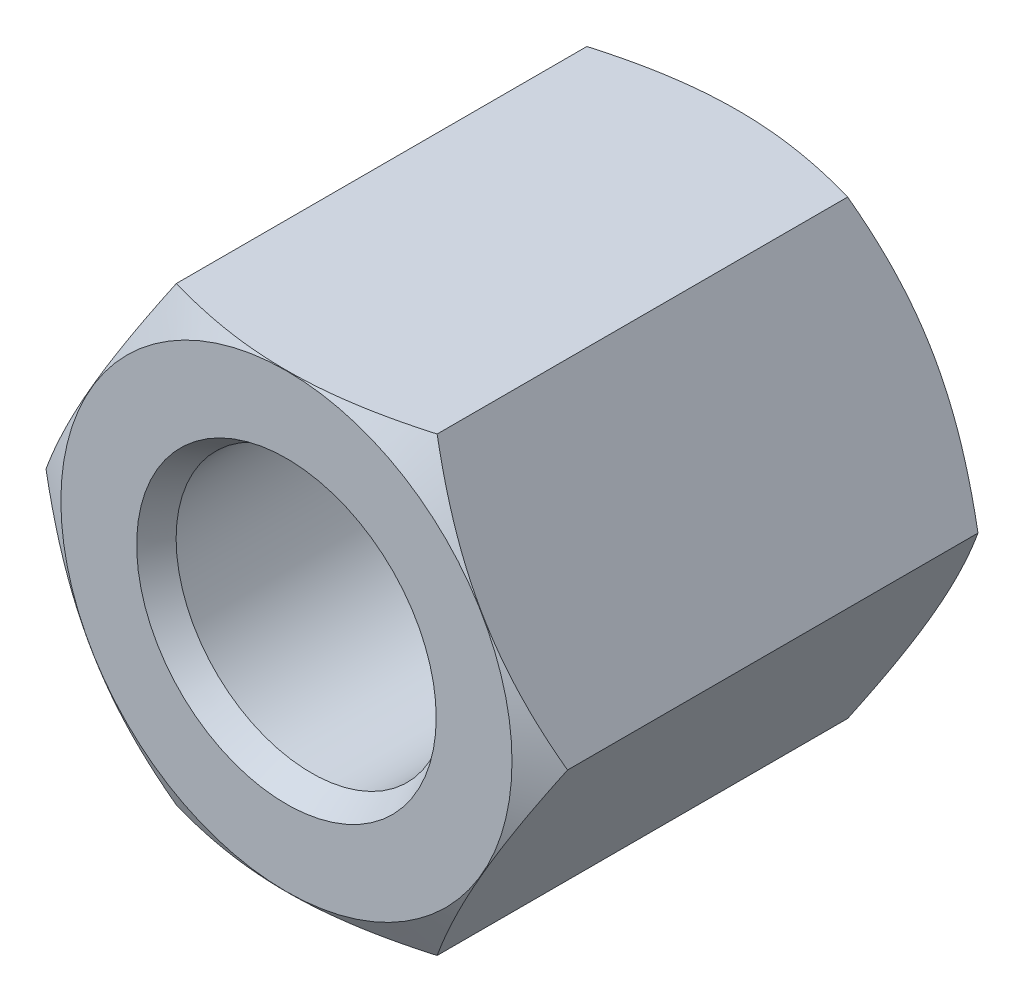
ISO-10303-21;
HEADER;
FILE_DESCRIPTION(('STEP AP214'),'2;1');
FILE_NAME('part.step','',(''),(''),'','','');
FILE_SCHEMA(('AUTOMOTIVE_DESIGN { 1 0 10303 214 1 1 1 1 }'));
ENDSEC;
DATA;
#1=APPLICATION_CONTEXT('core data for automotive mechanical design processes');
#2=APPLICATION_PROTOCOL_DEFINITION('international standard','automotive_design',2000,#1);
#3=PRODUCT_CONTEXT('',#1,'mechanical');
#4=PRODUCT('Part','Part','',(#3));
#5=PRODUCT_RELATED_PRODUCT_CATEGORY('part','',(#4));
#6=PRODUCT_DEFINITION_FORMATION('','',#4);
#7=PRODUCT_DEFINITION_CONTEXT('part definition',#1,'design');
#8=PRODUCT_DEFINITION('design','',#6,#7);
#9=PRODUCT_DEFINITION_SHAPE('','',#8);
#10=(LENGTH_UNIT() NAMED_UNIT(*) SI_UNIT(.MILLI.,.METRE.));
#11=(NAMED_UNIT(*) PLANE_ANGLE_UNIT() SI_UNIT($,.RADIAN.));
#12=(NAMED_UNIT(*) SI_UNIT($,.STERADIAN.) SOLID_ANGLE_UNIT());
#13=UNCERTAINTY_MEASURE_WITH_UNIT(LENGTH_MEASURE(1.E-05),#10,'distance_accuracy_value','');
#14=(GEOMETRIC_REPRESENTATION_CONTEXT(3) GLOBAL_UNCERTAINTY_ASSIGNED_CONTEXT((#13)) GLOBAL_UNIT_ASSIGNED_CONTEXT((#10,
#11,#12)) REPRESENTATION_CONTEXT('',''));
#15=CARTESIAN_POINT('',(0.,0.,0.));
#16=DIRECTION('',(0.,0.,1.));
#17=DIRECTION('',(1.,0.,0.));
#18=AXIS2_PLACEMENT_3D('',#15,#16,#17);
#19=CARTESIAN_POINT('',(0.,0.,4.72287187079));
#20=DIRECTION('',(0.,0.,-1.));
#21=DIRECTION('',(1.,0.,0.));
#22=AXIS2_PLACEMENT_3D('',#19,#20,#21);
#23=CYLINDRICAL_SURFACE('',#22,1.5);
#24=CARTESIAN_POINT('',(0.,0.,4.72287187079));
#25=DIRECTION('',(0.,0.,1.));
#26=DIRECTION('',(1.,0.,0.));
#27=AXIS2_PLACEMENT_3D('',#24,#25,#26);
#28=CIRCLE('',#27,1.5);
#29=CARTESIAN_POINT('',(1.5,0.,4.72287187079));
#30=VERTEX_POINT('',#29);
#31=EDGE_CURVE('E133',#30,#30,#28,.T.);
#32=ORIENTED_EDGE('',*,*,#31,.T.);
#33=DIRECTION('',(0.,0.,-1.));
#34=VECTOR('',#33,1.);
#35=CARTESIAN_POINT('',(1.5,0.,4.72287187079));
#36=LINE('',#35,#34);
#37=CARTESIAN_POINT('',(1.5,0.,2.5));
#38=VERTEX_POINT('',#37);
#39=EDGE_CURVE('E11',#30,#38,#36,.T.);
#40=ORIENTED_EDGE('',*,*,#39,.T.);
#41=CARTESIAN_POINT('',(0.,0.,2.5));
#42=DIRECTION('',(0.,0.,1.));
#43=DIRECTION('',(1.,0.,0.));
#44=AXIS2_PLACEMENT_3D('',#41,#42,#43);
#45=CIRCLE('',#44,1.5);
#46=EDGE_CURVE('E135',#38,#38,#45,.T.);
#47=ORIENTED_EDGE('',*,*,#46,.F.);
#48=ORIENTED_EDGE('',*,*,#39,.F.);
#49=EDGE_LOOP('',(#32,#40,#47,#48));
#50=FACE_BOUND('',#49,.T.);
#51=ADVANCED_FACE('F16',(#50),#23,.F.);
#52=CARTESIAN_POINT('',(0.,0.,2.5));
#53=DIRECTION('',(0.,0.,-1.));
#54=DIRECTION('',(1.,0.,0.));
#55=AXIS2_PLACEMENT_3D('',#52,#53,#54);
#56=CYLINDRICAL_SURFACE('',#55,1.5);
#57=ORIENTED_EDGE('',*,*,#46,.T.);
#58=DIRECTION('',(0.,0.,-1.));
#59=VECTOR('',#58,1.);
#60=CARTESIAN_POINT('',(1.5,0.,2.5));
#61=LINE('',#60,#59);
#62=CARTESIAN_POINT('',(1.5,0.,0.27712812921));
#63=VERTEX_POINT('',#62);
#64=EDGE_CURVE('E20',#38,#63,#61,.T.);
#65=ORIENTED_EDGE('',*,*,#64,.T.);
#66=CARTESIAN_POINT('',(0.,0.,0.27712812921));
#67=DIRECTION('',(0.,0.,1.));
#68=DIRECTION('',(1.,0.,0.));
#69=AXIS2_PLACEMENT_3D('',#66,#67,#68);
#70=CIRCLE('',#69,1.5);
#71=EDGE_CURVE('E191',#63,#63,#70,.T.);
#72=ORIENTED_EDGE('',*,*,#71,.F.);
#73=ORIENTED_EDGE('',*,*,#64,.F.);
#74=EDGE_LOOP('',(#57,#65,#72,#73));
#75=FACE_BOUND('',#74,.T.);
#76=ADVANCED_FACE('F311',(#75),#56,.F.);
#77=CARTESIAN_POINT('',(0.,0.,5.));
#78=DIRECTION('',(0.,0.,1.));
#79=DIRECTION('',(1.,0.,0.));
#80=AXIS2_PLACEMENT_3D('',#77,#78,#79);
#81=CONICAL_SURFACE('',#80,1.66,0.5235987756);
#82=CARTESIAN_POINT('',(0.,0.,5.));
#83=DIRECTION('',(0.,0.,1.));
#84=DIRECTION('',(1.,0.,0.));
#85=AXIS2_PLACEMENT_3D('',#82,#83,#84);
#86=CIRCLE('',#85,1.66);
#87=CARTESIAN_POINT('',(1.66,0.,5.));
#88=VERTEX_POINT('',#87);
#89=EDGE_CURVE('E169',#88,#88,#86,.T.);
#90=ORIENTED_EDGE('',*,*,#89,.T.);
#91=DIRECTION('',(-0.50000000000094,0.,-0.866025403783896));
#92=VECTOR('',#91,1.);
#93=CARTESIAN_POINT('',(1.66,0.,5.));
#94=LINE('',#93,#92);
#95=EDGE_CURVE('E136',#88,#30,#94,.T.);
#96=ORIENTED_EDGE('',*,*,#95,.T.);
#97=ORIENTED_EDGE('',*,*,#31,.F.);
#98=ORIENTED_EDGE('',*,*,#95,.F.);
#99=EDGE_LOOP('',(#90,#96,#97,#98));
#100=FACE_BOUND('',#99,.T.);
#101=ADVANCED_FACE('F316',(#100),#81,.F.);
#102=CARTESIAN_POINT('',(0.,0.,0.27712812921));
#103=DIRECTION('',(0.,0.,-1.));
#104=DIRECTION('',(1.,0.,0.));
#105=AXIS2_PLACEMENT_3D('',#102,#103,#104);
#106=CONICAL_SURFACE('',#105,1.5,0.5235987756);
#107=ORIENTED_EDGE('',*,*,#71,.T.);
#108=DIRECTION('',(0.50000000000094,0.,-0.866025403783896));
#109=VECTOR('',#108,1.);
#110=CARTESIAN_POINT('',(1.5,0.,0.27712812921));
#111=LINE('',#110,#109);
#112=CARTESIAN_POINT('',(1.66,0.,0.));
#113=VERTEX_POINT('',#112);
#114=EDGE_CURVE('E247',#63,#113,#111,.T.);
#115=ORIENTED_EDGE('',*,*,#114,.T.);
#116=CARTESIAN_POINT('',(0.,0.,0.));
#117=DIRECTION('',(0.,0.,1.));
#118=DIRECTION('',(1.,0.,0.));
#119=AXIS2_PLACEMENT_3D('',#116,#117,#118);
#120=CIRCLE('',#119,1.66);
#121=EDGE_CURVE('E165',#113,#113,#120,.T.);
#122=ORIENTED_EDGE('',*,*,#121,.F.);
#123=ORIENTED_EDGE('',*,*,#114,.F.);
#124=EDGE_LOOP('',(#107,#115,#122,#123));
#125=FACE_BOUND('',#124,.T.);
#126=ADVANCED_FACE('F290',(#125),#106,.F.);
#127=CARTESIAN_POINT('',(0.,0.,5.));
#128=DIRECTION('',(0.,0.,1.));
#129=DIRECTION('',(1.,0.,0.));
#130=AXIS2_PLACEMENT_3D('',#127,#128,#129);
#131=PLANE('',#130);
#132=ORIENTED_EDGE('',*,*,#89,.F.);
#133=EDGE_LOOP('',(#132));
#134=FACE_BOUND('',#133,.T.);
#135=CARTESIAN_POINT('',(0.,0.,5.));
#136=DIRECTION('',(0.,0.,1.));
#137=DIRECTION('',(1.,0.,0.));
#138=AXIS2_PLACEMENT_3D('',#135,#136,#137);
#139=CIRCLE('',#138,2.5);
#140=CARTESIAN_POINT('',(2.5,0.,5.));
#141=VERTEX_POINT('',#140);
#142=EDGE_CURVE('E112',#141,#141,#139,.T.);
#143=ORIENTED_EDGE('',*,*,#142,.T.);
#144=EDGE_LOOP('',(#143));
#145=FACE_BOUND('',#144,.T.);
#146=ADVANCED_FACE('F113',(#134,#145),#131,.T.);
#147=CARTESIAN_POINT('',(0.,0.,0.));
#148=DIRECTION('',(0.,0.,1.));
#149=DIRECTION('',(1.,0.,0.));
#150=AXIS2_PLACEMENT_3D('',#147,#148,#149);
#151=PLANE('',#150);
#152=CARTESIAN_POINT('',(0.,0.,0.));
#153=DIRECTION('',(0.,0.,1.));
#154=DIRECTION('',(1.,0.,0.));
#155=AXIS2_PLACEMENT_3D('',#152,#153,#154);
#156=CIRCLE('',#155,2.5);
#157=CARTESIAN_POINT('',(2.5,0.,0.));
#158=VERTEX_POINT('',#157);
#159=EDGE_CURVE('E143',#158,#158,#156,.T.);
#160=ORIENTED_EDGE('',*,*,#159,.F.);
#161=EDGE_LOOP('',(#160));
#162=FACE_BOUND('',#161,.T.);
#163=ORIENTED_EDGE('',*,*,#121,.T.);
#164=EDGE_LOOP('',(#163));
#165=FACE_BOUND('',#164,.T.);
#166=ADVANCED_FACE('F292',(#162,#165),#151,.F.);
#167=CARTESIAN_POINT('',(-1.445,-2.502813416937,0.));
#168=DIRECTION('',(0.,1.,0.));
#169=DIRECTION('',(1.,0.,0.));
#170=AXIS2_PLACEMENT_3D('',#167,#168,#169);
#171=PLANE('',#170);
#172=DIRECTION('',(0.,0.,1.));
#173=VECTOR('',#172,1.);
#174=CARTESIAN_POINT('',(1.445,-2.502813416937,0.));
#175=LINE('',#174,#173);
#176=CARTESIAN_POINT('',(1.445,-2.502813416937,0.225166604984));
#177=VERTEX_POINT('',#176);
#178=CARTESIAN_POINT('',(1.445,-2.502813416937,4.774833395016));
#179=VERTEX_POINT('',#178);
#180=EDGE_CURVE('E150',#177,#179,#175,.T.);
#181=ORIENTED_EDGE('',*,*,#180,.T.);
#182=CARTESIAN_POINT('',(1.44500000000008,-2.502813416937,4.77483339501595));
#183=CARTESIAN_POINT('',(0.,-2.50281341693702,5.1919689645055));
#184=CARTESIAN_POINT('',(-1.44499999999997,-2.502813416937,4.77483339501598));
#185=(BOUNDED_CURVE() B_SPLINE_CURVE(2,(#182,#183,#184),.UNSPECIFIED.,.F.,
.F.) B_SPLINE_CURVE_WITH_KNOTS((3,3),(0.,1.),
.UNSPECIFIED.) CURVE() GEOMETRIC_REPRESENTATION_ITEM() RATIONAL_B_SPLINE_CURVE((1.,
1.15470053837926,1.)) REPRESENTATION_ITEM(''));
#186=CARTESIAN_POINT('',(-1.445,-2.502813416937,4.774833395016));
#187=VERTEX_POINT('',#186);
#188=EDGE_CURVE('E153',#179,#187,#185,.T.);
#189=ORIENTED_EDGE('',*,*,#188,.T.);
#190=DIRECTION('',(0.,0.,1.));
#191=VECTOR('',#190,1.);
#192=CARTESIAN_POINT('',(-1.445,-2.502813416937,0.));
#193=LINE('',#192,#191);
#194=CARTESIAN_POINT('',(-1.445,-2.502813416937,0.225166604984));
#195=VERTEX_POINT('',#194);
#196=EDGE_CURVE('E149',#195,#187,#193,.T.);
#197=ORIENTED_EDGE('',*,*,#196,.F.);
#198=CARTESIAN_POINT('',(-1.44500000000008,-2.502813416937,0.225166604984046));
#199=CARTESIAN_POINT('',(0.,-2.50281341693701,-0.191968964505495));
#200=CARTESIAN_POINT('',(1.44499999999997,-2.502813416937,0.225166604984016));
#201=(BOUNDED_CURVE() B_SPLINE_CURVE(2,(#198,#199,#200),.UNSPECIFIED.,.F.,
.F.) B_SPLINE_CURVE_WITH_KNOTS((3,3),(0.,1.),
.UNSPECIFIED.) CURVE() GEOMETRIC_REPRESENTATION_ITEM() RATIONAL_B_SPLINE_CURVE((1.,
1.15470053837926,1.)) REPRESENTATION_ITEM(''));
#202=EDGE_CURVE('E142',#195,#177,#201,.T.);
#203=ORIENTED_EDGE('',*,*,#202,.T.);
#204=EDGE_LOOP('',(#181,#189,#197,#203));
#205=FACE_BOUND('',#204,.T.);
#206=ADVANCED_FACE('F294',(#205),#171,.F.);
#207=CARTESIAN_POINT('',(-2.89,0.,0.));
#208=DIRECTION('',(0.866025403784329,0.50000000000019,0.));
#209=DIRECTION('',(0.,0.,-1.));
#210=AXIS2_PLACEMENT_3D('',#207,#208,#209);
#211=PLANE('',#210);
#212=ORIENTED_EDGE('',*,*,#196,.T.);
#213=CARTESIAN_POINT('',(-1.44499999999986,-2.50281341693713,4.77483339501589));
#214=CARTESIAN_POINT('',(-2.16750000000006,-1.25140670846891,5.19196896450558));
#215=CARTESIAN_POINT('',(-2.89000000000029,-6.22391027604863E-13,4.77483339501581));
#216=(BOUNDED_CURVE() B_SPLINE_CURVE(2,(#213,#214,#215),.UNSPECIFIED.,.F.,
.F.) B_SPLINE_CURVE_WITH_KNOTS((3,3),(0.,1.),
.UNSPECIFIED.) CURVE() GEOMETRIC_REPRESENTATION_ITEM() RATIONAL_B_SPLINE_CURVE((1.,
1.15470053837934,1.)) REPRESENTATION_ITEM(''));
#217=CARTESIAN_POINT('',(-2.89,0.,4.774833395016));
#218=VERTEX_POINT('',#217);
#219=EDGE_CURVE('E124',#187,#218,#216,.T.);
#220=ORIENTED_EDGE('',*,*,#219,.T.);
#221=DIRECTION('',(0.,0.,1.));
#222=VECTOR('',#221,1.);
#223=CARTESIAN_POINT('',(-2.89,0.,0.));
#224=LINE('',#223,#222);
#225=CARTESIAN_POINT('',(-2.89,0.,0.225166604984));
#226=VERTEX_POINT('',#225);
#227=EDGE_CURVE('E105',#226,#218,#224,.T.);
#228=ORIENTED_EDGE('',*,*,#227,.F.);
#229=CARTESIAN_POINT('',(-2.89000000000094,5.09592368302947E-13,0.225166604984566));
#230=CARTESIAN_POINT('',(-2.16750000000034,-1.2514067084684,-0.191968964505698));
#231=CARTESIAN_POINT('',(-1.44499999999998,-2.50281341693691,0.225166604984036));
#232=(BOUNDED_CURVE() B_SPLINE_CURVE(2,(#229,#230,#231),.UNSPECIFIED.,.F.,
.F.) B_SPLINE_CURVE_WITH_KNOTS((3,3),(0.,1.),
.UNSPECIFIED.) CURVE() GEOMETRIC_REPRESENTATION_ITEM() RATIONAL_B_SPLINE_CURVE((1.,
1.15470053837945,1.)) REPRESENTATION_ITEM(''));
#233=EDGE_CURVE('E159',#226,#195,#232,.T.);
#234=ORIENTED_EDGE('',*,*,#233,.T.);
#235=EDGE_LOOP('',(#212,#220,#228,#234));
#236=FACE_BOUND('',#235,.T.);
#237=ADVANCED_FACE('F302',(#236),#211,.F.);
#238=CARTESIAN_POINT('',(-1.445,2.502813416937,0.));
#239=DIRECTION('',(0.866025403784329,-0.50000000000019,0.));
#240=DIRECTION('',(0.,0.,-1.));
#241=AXIS2_PLACEMENT_3D('',#238,#239,#240);
#242=PLANE('',#241);
#243=ORIENTED_EDGE('',*,*,#227,.T.);
#244=CARTESIAN_POINT('',(-2.89000000000108,-7.4718009557273E-13,4.77483339501536));
#245=CARTESIAN_POINT('',(-2.1675000000004,1.25140670846831,5.19196896450573));
#246=CARTESIAN_POINT('',(-1.44499999999998,2.50281341693692,4.77483339501596));
#247=(BOUNDED_CURVE() B_SPLINE_CURVE(2,(#244,#245,#246),.UNSPECIFIED.,.F.,
.F.) B_SPLINE_CURVE_WITH_KNOTS((3,3),(0.,1.),
.UNSPECIFIED.) CURVE() GEOMETRIC_REPRESENTATION_ITEM() RATIONAL_B_SPLINE_CURVE((1.,
1.15470053837947,1.)) REPRESENTATION_ITEM(''));
#248=CARTESIAN_POINT('',(-1.445,2.502813416937,4.774833395016));
#249=VERTEX_POINT('',#248);
#250=EDGE_CURVE('E117',#218,#249,#247,.T.);
#251=ORIENTED_EDGE('',*,*,#250,.T.);
#252=DIRECTION('',(0.,0.,1.));
#253=VECTOR('',#252,1.);
#254=CARTESIAN_POINT('',(-1.445,2.502813416937,0.));
#255=LINE('',#254,#253);
#256=CARTESIAN_POINT('',(-1.445,2.502813416937,0.225166604984));
#257=VERTEX_POINT('',#256);
#258=EDGE_CURVE('E131',#257,#249,#255,.T.);
#259=ORIENTED_EDGE('',*,*,#258,.F.);
#260=CARTESIAN_POINT('',(-1.44499999999986,2.50281341693713,0.225166604984106));
#261=CARTESIAN_POINT('',(-2.16750000000007,1.25140670846888,-0.191968964505593));
#262=CARTESIAN_POINT('',(-2.89000000000033,5.42899059041702E-13,0.225166604984216));
#263=(BOUNDED_CURVE() B_SPLINE_CURVE(2,(#260,#261,#262),.UNSPECIFIED.,.F.,
.F.) B_SPLINE_CURVE_WITH_KNOTS((3,3),(0.,1.),
.UNSPECIFIED.) CURVE() GEOMETRIC_REPRESENTATION_ITEM() RATIONAL_B_SPLINE_CURVE((1.,
1.15470053837935,1.)) REPRESENTATION_ITEM(''));
#264=EDGE_CURVE('E175',#257,#226,#263,.T.);
#265=ORIENTED_EDGE('',*,*,#264,.T.);
#266=EDGE_LOOP('',(#243,#251,#259,#265));
#267=FACE_BOUND('',#266,.T.);
#268=ADVANCED_FACE('F342',(#267),#242,.F.);
#269=CARTESIAN_POINT('',(1.445,-2.502813416937,0.));
#270=DIRECTION('',(-0.866025403784329,0.50000000000019,0.));
#271=DIRECTION('',(0.,0.,1.));
#272=AXIS2_PLACEMENT_3D('',#269,#270,#271);
#273=PLANE('',#272);
#274=DIRECTION('',(0.,0.,1.));
#275=VECTOR('',#274,1.);
#276=CARTESIAN_POINT('',(2.89,0.,0.225166604984));
#277=LINE('',#276,#275);
#278=CARTESIAN_POINT('',(2.89,0.,0.225166604984));
#279=VERTEX_POINT('',#278);
#280=CARTESIAN_POINT('',(2.89,0.,4.774833395016));
#281=VERTEX_POINT('',#280);
#282=EDGE_CURVE('E222',#279,#281,#277,.T.);
#283=ORIENTED_EDGE('',*,*,#282,.T.);
#284=CARTESIAN_POINT('',(2.89000000000101,6.29496454962464E-13,4.77483339501539));
#285=CARTESIAN_POINT('',(2.16750000000037,-1.25140670846836,5.19196896450572));
#286=CARTESIAN_POINT('',(1.44499999999998,-2.50281341693692,4.77483339501596));
#287=(BOUNDED_CURVE() B_SPLINE_CURVE(2,(#284,#285,#286),.UNSPECIFIED.,.F.,
.F.) B_SPLINE_CURVE_WITH_KNOTS((3,3),(0.,1.),
.UNSPECIFIED.) CURVE() GEOMETRIC_REPRESENTATION_ITEM() RATIONAL_B_SPLINE_CURVE((1.,
1.15470053837946,1.)) REPRESENTATION_ITEM(''));
#288=EDGE_CURVE('E127',#281,#179,#287,.T.);
#289=ORIENTED_EDGE('',*,*,#288,.T.);
#290=ORIENTED_EDGE('',*,*,#180,.F.);
#291=CARTESIAN_POINT('',(1.44499999999986,-2.50281341693713,0.225166604984106));
#292=CARTESIAN_POINT('',(2.16750000000006,-1.25140670846889,-0.191968964505588));
#293=CARTESIAN_POINT('',(2.89000000000031,-5.83089132533132E-13,0.225166604984202));
#294=(BOUNDED_CURVE() B_SPLINE_CURVE(2,(#291,#292,#293),.UNSPECIFIED.,.F.,
.F.) B_SPLINE_CURVE_WITH_KNOTS((3,3),(0.,1.),
.UNSPECIFIED.) CURVE() GEOMETRIC_REPRESENTATION_ITEM() RATIONAL_B_SPLINE_CURVE((1.,
1.15470053837935,1.)) REPRESENTATION_ITEM(''));
#295=EDGE_CURVE('E137',#177,#279,#294,.T.);
#296=ORIENTED_EDGE('',*,*,#295,.T.);
#297=EDGE_LOOP('',(#283,#289,#290,#296));
#298=FACE_BOUND('',#297,.T.);
#299=ADVANCED_FACE('F18',(#298),#273,.F.);
#300=CARTESIAN_POINT('',(0.,0.,4.774833395016));
#301=DIRECTION('',(0.,0.,-1.));
#302=DIRECTION('',(1.,0.,0.));
#303=AXIS2_PLACEMENT_3D('',#300,#301,#302);
#304=CONICAL_SURFACE('',#303,2.89,1.047197551197);
#305=ORIENTED_EDGE('',*,*,#288,.F.);
#306=DIRECTION('',(-0.866025403784329,0.,0.50000000000019));
#307=VECTOR('',#306,1.);
#308=CARTESIAN_POINT('',(2.89,0.,4.774833395016));
#309=LINE('',#308,#307);
#310=EDGE_CURVE('E118',#281,#141,#309,.T.);
#311=ORIENTED_EDGE('',*,*,#310,.T.);
#312=ORIENTED_EDGE('',*,*,#142,.F.);
#313=ORIENTED_EDGE('',*,*,#310,.F.);
#314=CARTESIAN_POINT('',(1.44499999999986,2.50281341693713,4.77483339501589));
#315=CARTESIAN_POINT('',(2.16750000000006,1.25140670846889,5.19196896450558));
#316=CARTESIAN_POINT('',(2.89000000000031,5.83311177138057E-13,4.7748333950158));
#317=(BOUNDED_CURVE() B_SPLINE_CURVE(2,(#314,#315,#316),.UNSPECIFIED.,.F.,
.F.) B_SPLINE_CURVE_WITH_KNOTS((3,3),(0.,1.),
.UNSPECIFIED.) CURVE() GEOMETRIC_REPRESENTATION_ITEM() RATIONAL_B_SPLINE_CURVE((1.,
1.15470053837934,1.)) REPRESENTATION_ITEM(''));
#318=CARTESIAN_POINT('',(1.445,2.502813416937,4.774833395016));
#319=VERTEX_POINT('',#318);
#320=EDGE_CURVE('E198',#319,#281,#317,.T.);
#321=ORIENTED_EDGE('',*,*,#320,.F.);
#322=CARTESIAN_POINT('',(-1.44500000000008,2.502813416937,4.77483339501595));
#323=CARTESIAN_POINT('',(0.,2.50281341693702,5.1919689645055));
#324=CARTESIAN_POINT('',(1.44499999999997,2.502813416937,4.77483339501598));
#325=(BOUNDED_CURVE() B_SPLINE_CURVE(2,(#322,#323,#324),.UNSPECIFIED.,.F.,
.F.) B_SPLINE_CURVE_WITH_KNOTS((3,3),(0.,1.),
.UNSPECIFIED.) CURVE() GEOMETRIC_REPRESENTATION_ITEM() RATIONAL_B_SPLINE_CURVE((1.,
1.15470053837926,1.)) REPRESENTATION_ITEM(''));
#326=EDGE_CURVE('E184',#249,#319,#325,.T.);
#327=ORIENTED_EDGE('',*,*,#326,.F.);
#328=ORIENTED_EDGE('',*,*,#250,.F.);
#329=ORIENTED_EDGE('',*,*,#219,.F.);
#330=ORIENTED_EDGE('',*,*,#188,.F.);
#331=EDGE_LOOP('',(#305,#311,#312,#313,#321,#327,#328,#329,#330));
#332=FACE_BOUND('',#331,.T.);
#333=ADVANCED_FACE('F330',(#332),#304,.T.);
#334=CARTESIAN_POINT('',(1.445,2.502813416937,0.));
#335=DIRECTION('',(0.,-1.,0.));
#336=DIRECTION('',(-1.,0.,0.));
#337=AXIS2_PLACEMENT_3D('',#334,#335,#336);
#338=PLANE('',#337);
#339=ORIENTED_EDGE('',*,*,#258,.T.);
#340=ORIENTED_EDGE('',*,*,#326,.T.);
#341=DIRECTION('',(0.,0.,1.));
#342=VECTOR('',#341,1.);
#343=CARTESIAN_POINT('',(1.445,2.502813416937,0.));
#344=LINE('',#343,#342);
#345=CARTESIAN_POINT('',(1.445,2.502813416937,0.225166604984));
#346=VERTEX_POINT('',#345);
#347=EDGE_CURVE('E195',#346,#319,#344,.T.);
#348=ORIENTED_EDGE('',*,*,#347,.F.);
#349=CARTESIAN_POINT('',(1.44500000000008,2.502813416937,0.225166604984046));
#350=CARTESIAN_POINT('',(0.,2.50281341693701,-0.191968964505495));
#351=CARTESIAN_POINT('',(-1.44499999999997,2.502813416937,0.225166604984016));
#352=(BOUNDED_CURVE() B_SPLINE_CURVE(2,(#349,#350,#351),.UNSPECIFIED.,.F.,
.F.) B_SPLINE_CURVE_WITH_KNOTS((3,3),(0.,1.),
.UNSPECIFIED.) CURVE() GEOMETRIC_REPRESENTATION_ITEM() RATIONAL_B_SPLINE_CURVE((1.,
1.15470053837926,1.)) REPRESENTATION_ITEM(''));
#353=EDGE_CURVE('E251',#346,#257,#352,.T.);
#354=ORIENTED_EDGE('',*,*,#353,.T.);
#355=EDGE_LOOP('',(#339,#340,#348,#354));
#356=FACE_BOUND('',#355,.T.);
#357=ADVANCED_FACE('F323',(#356),#338,.F.);
#358=CARTESIAN_POINT('',(0.,0.,0.));
#359=DIRECTION('',(0.,0.,1.));
#360=DIRECTION('',(1.,0.,0.));
#361=AXIS2_PLACEMENT_3D('',#358,#359,#360);
#362=CONICAL_SURFACE('',#361,2.5,1.047197551197);
#363=DIRECTION('',(0.866025403784329,0.,0.50000000000019));
#364=VECTOR('',#363,1.);
#365=CARTESIAN_POINT('',(2.5,0.,0.));
#366=LINE('',#365,#364);
#367=EDGE_CURVE('E194',#158,#279,#366,.T.);
#368=ORIENTED_EDGE('',*,*,#367,.F.);
#369=ORIENTED_EDGE('',*,*,#159,.T.);
#370=ORIENTED_EDGE('',*,*,#367,.T.);
#371=ORIENTED_EDGE('',*,*,#295,.F.);
#372=ORIENTED_EDGE('',*,*,#202,.F.);
#373=ORIENTED_EDGE('',*,*,#233,.F.);
#374=ORIENTED_EDGE('',*,*,#264,.F.);
#375=ORIENTED_EDGE('',*,*,#353,.F.);
#376=CARTESIAN_POINT('',(2.89000000000101,-6.28830321147689E-13,0.225166604984606));
#377=CARTESIAN_POINT('',(2.16750000000037,1.25140670846836,-0.191968964505713));
#378=CARTESIAN_POINT('',(1.44499999999998,2.50281341693691,0.225166604984036));
#379=(BOUNDED_CURVE() B_SPLINE_CURVE(2,(#376,#377,#378),.UNSPECIFIED.,.F.,
.F.) B_SPLINE_CURVE_WITH_KNOTS((3,3),(0.,1.),
.UNSPECIFIED.) CURVE() GEOMETRIC_REPRESENTATION_ITEM() RATIONAL_B_SPLINE_CURVE((1.,
1.15470053837946,1.)) REPRESENTATION_ITEM(''));
#380=EDGE_CURVE('E214',#279,#346,#379,.T.);
#381=ORIENTED_EDGE('',*,*,#380,.F.);
#382=EDGE_LOOP('',(#368,#369,#370,#371,#372,#373,#374,#375,#381));
#383=FACE_BOUND('',#382,.T.);
#384=ADVANCED_FACE('F320',(#383),#362,.T.);
#385=CARTESIAN_POINT('',(2.89,0.,0.));
#386=DIRECTION('',(-0.866025403784329,-0.50000000000019,0.));
#387=DIRECTION('',(-0.50000000000019,0.866025403784329,0.));
#388=AXIS2_PLACEMENT_3D('',#385,#386,#387);
#389=PLANE('',#388);
#390=ORIENTED_EDGE('',*,*,#347,.T.);
#391=ORIENTED_EDGE('',*,*,#320,.T.);
#392=ORIENTED_EDGE('',*,*,#282,.F.);
#393=ORIENTED_EDGE('',*,*,#380,.T.);
#394=EDGE_LOOP('',(#390,#391,#392,#393));
#395=FACE_BOUND('',#394,.T.);
#396=ADVANCED_FACE('F322',(#395),#389,.F.);
#397=CLOSED_SHELL('',(#51,#76,#101,#126,#146,#166,#206,#237,#268,#299,#333,#357,#384,#396));
#398=MANIFOLD_SOLID_BREP('B1',#397);
#399=ADVANCED_BREP_SHAPE_REPRESENTATION('',(#18,#398),#14);
#400=SHAPE_DEFINITION_REPRESENTATION(#9,#399);
ENDSEC;
END-ISO-10303-21;
